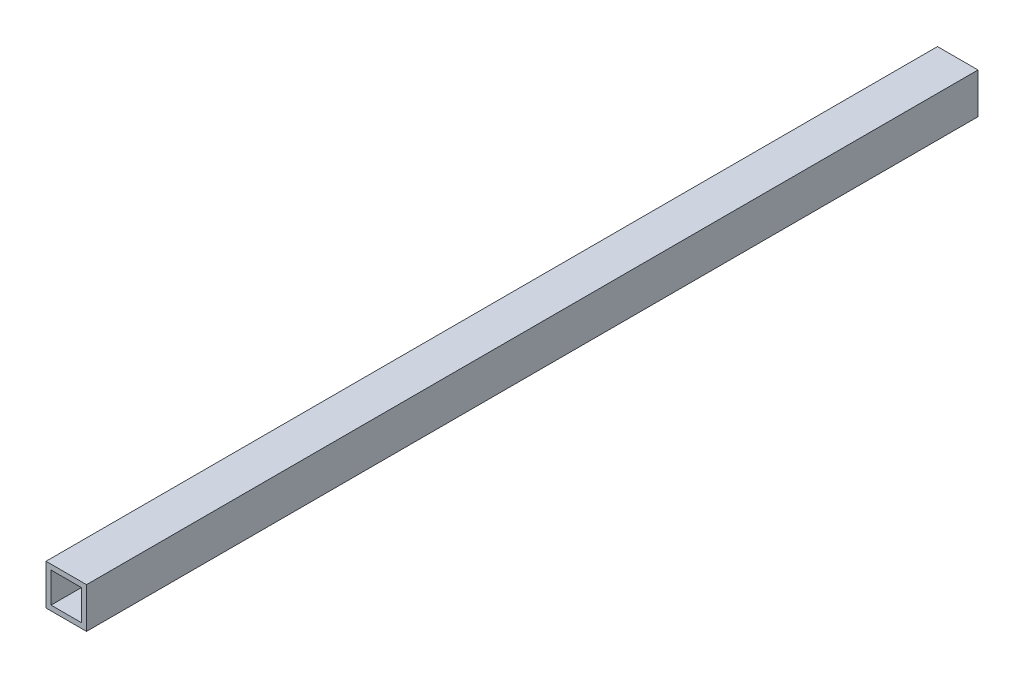
ISO-10303-21;
HEADER;
FILE_DESCRIPTION(('STEP AP214'),'2;1');
FILE_NAME('part.step','',(''),(''),'','','');
FILE_SCHEMA(('AUTOMOTIVE_DESIGN { 1 0 10303 214 1 1 1 1 }'));
ENDSEC;
DATA;
#1=APPLICATION_CONTEXT('core data for automotive mechanical design processes');
#2=APPLICATION_PROTOCOL_DEFINITION('international standard','automotive_design',2000,#1);
#3=PRODUCT_CONTEXT('',#1,'mechanical');
#4=PRODUCT('Part','Part','',(#3));
#5=PRODUCT_RELATED_PRODUCT_CATEGORY('part','',(#4));
#6=PRODUCT_DEFINITION_FORMATION('','',#4);
#7=PRODUCT_DEFINITION_CONTEXT('part definition',#1,'design');
#8=PRODUCT_DEFINITION('design','',#6,#7);
#9=PRODUCT_DEFINITION_SHAPE('','',#8);
#10=(LENGTH_UNIT() NAMED_UNIT(*) SI_UNIT(.MILLI.,.METRE.));
#11=(NAMED_UNIT(*) PLANE_ANGLE_UNIT() SI_UNIT($,.RADIAN.));
#12=(NAMED_UNIT(*) SI_UNIT($,.STERADIAN.) SOLID_ANGLE_UNIT());
#13=UNCERTAINTY_MEASURE_WITH_UNIT(LENGTH_MEASURE(1.E-05),#10,'distance_accuracy_value','');
#14=(GEOMETRIC_REPRESENTATION_CONTEXT(3) GLOBAL_UNCERTAINTY_ASSIGNED_CONTEXT((#13)) GLOBAL_UNIT_ASSIGNED_CONTEXT((#10,
#11,#12)) REPRESENTATION_CONTEXT('',''));
#15=CARTESIAN_POINT('',(0.,0.,0.));
#16=DIRECTION('',(0.,0.,1.));
#17=DIRECTION('',(1.,0.,0.));
#18=AXIS2_PLACEMENT_3D('',#15,#16,#17);
#19=CARTESIAN_POINT('',(0.,0.,558.8));
#20=DIRECTION('',(0.,0.,-1.));
#21=DIRECTION('',(-1.,0.,0.));
#22=AXIS2_PLACEMENT_3D('',#19,#20,#21);
#23=PLANE('',#22);
#24=DIRECTION('',(0.,-1.,0.));
#25=VECTOR('',#24,1.);
#26=CARTESIAN_POINT('',(0.,0.,558.8));
#27=LINE('',#26,#25);
#28=CARTESIAN_POINT('',(0.,25.4,558.8));
#29=VERTEX_POINT('',#28);
#30=CARTESIAN_POINT('',(0.,0.,558.8));
#31=VERTEX_POINT('',#30);
#32=EDGE_CURVE('E156',#29,#31,#27,.T.);
#33=ORIENTED_EDGE('',*,*,#32,.T.);
#34=DIRECTION('',(1.,0.,0.));
#35=VECTOR('',#34,1.);
#36=CARTESIAN_POINT('',(0.,0.,558.8));
#37=LINE('',#36,#35);
#38=CARTESIAN_POINT('',(25.4,0.,558.8));
#39=VERTEX_POINT('',#38);
#40=EDGE_CURVE('E160',#31,#39,#37,.T.);
#41=ORIENTED_EDGE('',*,*,#40,.T.);
#42=DIRECTION('',(0.,1.,0.));
#43=VECTOR('',#42,1.);
#44=CARTESIAN_POINT('',(25.4,0.,558.8));
#45=LINE('',#44,#43);
#46=CARTESIAN_POINT('',(25.4,25.4,558.8));
#47=VERTEX_POINT('',#46);
#48=EDGE_CURVE('E164',#39,#47,#45,.T.);
#49=ORIENTED_EDGE('',*,*,#48,.T.);
#50=DIRECTION('',(-1.,0.,0.));
#51=VECTOR('',#50,1.);
#52=CARTESIAN_POINT('',(0.,25.4,558.8));
#53=LINE('',#52,#51);
#54=EDGE_CURVE('E167',#47,#29,#53,.T.);
#55=ORIENTED_EDGE('',*,*,#54,.T.);
#56=EDGE_LOOP('',(#33,#41,#49,#55));
#57=FACE_BOUND('',#56,.T.);
#58=DIRECTION('',(1.,0.,0.));
#59=VECTOR('',#58,1.);
#60=CARTESIAN_POINT('',(3.175,3.175,558.8));
#61=LINE('',#60,#59);
#62=CARTESIAN_POINT('',(3.175,3.175,558.8));
#63=VERTEX_POINT('',#62);
#64=CARTESIAN_POINT('',(22.225,3.175,558.8));
#65=VERTEX_POINT('',#64);
#66=EDGE_CURVE('E108',#63,#65,#61,.T.);
#67=ORIENTED_EDGE('',*,*,#66,.F.);
#68=DIRECTION('',(0.,-1.,0.));
#69=VECTOR('',#68,1.);
#70=CARTESIAN_POINT('',(3.175,3.175,558.8));
#71=LINE('',#70,#69);
#72=CARTESIAN_POINT('',(3.175,22.225,558.8));
#73=VERTEX_POINT('',#72);
#74=EDGE_CURVE('E134',#73,#63,#71,.T.);
#75=ORIENTED_EDGE('',*,*,#74,.F.);
#76=DIRECTION('',(-1.,0.,0.));
#77=VECTOR('',#76,1.);
#78=CARTESIAN_POINT('',(3.175,22.225,558.8));
#79=LINE('',#78,#77);
#80=CARTESIAN_POINT('',(22.225,22.225,558.8));
#81=VERTEX_POINT('',#80);
#82=EDGE_CURVE('E130',#81,#73,#79,.T.);
#83=ORIENTED_EDGE('',*,*,#82,.F.);
#84=DIRECTION('',(0.,1.,0.));
#85=VECTOR('',#84,1.);
#86=CARTESIAN_POINT('',(22.225,3.175,558.8));
#87=LINE('',#86,#85);
#88=EDGE_CURVE('E117',#65,#81,#87,.T.);
#89=ORIENTED_EDGE('',*,*,#88,.F.);
#90=EDGE_LOOP('',(#67,#75,#83,#89));
#91=FACE_BOUND('',#90,.T.);
#92=ADVANCED_FACE('F42',(#57,#91),#23,.F.);
#93=CARTESIAN_POINT('',(0.,0.,0.));
#94=DIRECTION('',(0.,0.,-1.));
#95=DIRECTION('',(-1.,0.,0.));
#96=AXIS2_PLACEMENT_3D('',#93,#94,#95);
#97=PLANE('',#96);
#98=DIRECTION('',(0.,-1.,0.));
#99=VECTOR('',#98,1.);
#100=CARTESIAN_POINT('',(0.,0.,0.));
#101=LINE('',#100,#99);
#102=CARTESIAN_POINT('',(0.,25.4,0.));
#103=VERTEX_POINT('',#102);
#104=CARTESIAN_POINT('',(0.,0.,0.));
#105=VERTEX_POINT('',#104);
#106=EDGE_CURVE('E126',#103,#105,#101,.T.);
#107=ORIENTED_EDGE('',*,*,#106,.F.);
#108=DIRECTION('',(-1.,0.,0.));
#109=VECTOR('',#108,1.);
#110=CARTESIAN_POINT('',(0.,25.4,0.));
#111=LINE('',#110,#109);
#112=CARTESIAN_POINT('',(25.4,25.4,0.));
#113=VERTEX_POINT('',#112);
#114=EDGE_CURVE('E161',#113,#103,#111,.T.);
#115=ORIENTED_EDGE('',*,*,#114,.F.);
#116=DIRECTION('',(0.,1.,0.));
#117=VECTOR('',#116,1.);
#118=CARTESIAN_POINT('',(25.4,0.,0.));
#119=LINE('',#118,#117);
#120=CARTESIAN_POINT('',(25.4,0.,0.));
#121=VERTEX_POINT('',#120);
#122=EDGE_CURVE('E177',#121,#113,#119,.T.);
#123=ORIENTED_EDGE('',*,*,#122,.F.);
#124=DIRECTION('',(1.,0.,0.));
#125=VECTOR('',#124,1.);
#126=CARTESIAN_POINT('',(0.,0.,0.));
#127=LINE('',#126,#125);
#128=EDGE_CURVE('E174',#105,#121,#127,.T.);
#129=ORIENTED_EDGE('',*,*,#128,.F.);
#130=EDGE_LOOP('',(#107,#115,#123,#129));
#131=FACE_BOUND('',#130,.T.);
#132=DIRECTION('',(0.,-1.,0.));
#133=VECTOR('',#132,1.);
#134=CARTESIAN_POINT('',(3.175,3.175,0.));
#135=LINE('',#134,#133);
#136=CARTESIAN_POINT('',(3.175,22.225,0.));
#137=VERTEX_POINT('',#136);
#138=CARTESIAN_POINT('',(3.175,3.175,0.));
#139=VERTEX_POINT('',#138);
#140=EDGE_CURVE('E118',#137,#139,#135,.T.);
#141=ORIENTED_EDGE('',*,*,#140,.T.);
#142=DIRECTION('',(1.,0.,0.));
#143=VECTOR('',#142,1.);
#144=CARTESIAN_POINT('',(3.175,3.175,0.));
#145=LINE('',#144,#143);
#146=CARTESIAN_POINT('',(22.225,3.175,0.));
#147=VERTEX_POINT('',#146);
#148=EDGE_CURVE('E66',#139,#147,#145,.T.);
#149=ORIENTED_EDGE('',*,*,#148,.T.);
#150=DIRECTION('',(0.,1.,0.));
#151=VECTOR('',#150,1.);
#152=CARTESIAN_POINT('',(22.225,3.175,0.));
#153=LINE('',#152,#151);
#154=CARTESIAN_POINT('',(22.225,22.225,0.));
#155=VERTEX_POINT('',#154);
#156=EDGE_CURVE('E124',#147,#155,#153,.T.);
#157=ORIENTED_EDGE('',*,*,#156,.T.);
#158=DIRECTION('',(-1.,0.,0.));
#159=VECTOR('',#158,1.);
#160=CARTESIAN_POINT('',(3.175,22.225,0.));
#161=LINE('',#160,#159);
#162=EDGE_CURVE('E143',#155,#137,#161,.T.);
#163=ORIENTED_EDGE('',*,*,#162,.T.);
#164=EDGE_LOOP('',(#141,#149,#157,#163));
#165=FACE_BOUND('',#164,.T.);
#166=ADVANCED_FACE('F200',(#131,#165),#97,.T.);
#167=CARTESIAN_POINT('',(0.,0.,558.8));
#168=DIRECTION('',(1.,0.,0.));
#169=DIRECTION('',(0.,0.,-1.));
#170=AXIS2_PLACEMENT_3D('',#167,#168,#169);
#171=PLANE('',#170);
#172=ORIENTED_EDGE('',*,*,#106,.T.);
#173=DIRECTION('',(0.,0.,-1.));
#174=VECTOR('',#173,1.);
#175=CARTESIAN_POINT('',(0.,0.,558.8));
#176=LINE('',#175,#174);
#177=EDGE_CURVE('E11',#31,#105,#176,.T.);
#178=ORIENTED_EDGE('',*,*,#177,.F.);
#179=ORIENTED_EDGE('',*,*,#32,.F.);
#180=DIRECTION('',(0.,0.,-1.));
#181=VECTOR('',#180,1.);
#182=CARTESIAN_POINT('',(0.,25.4,558.8));
#183=LINE('',#182,#181);
#184=EDGE_CURVE('E170',#29,#103,#183,.T.);
#185=ORIENTED_EDGE('',*,*,#184,.T.);
#186=EDGE_LOOP('',(#172,#178,#179,#185));
#187=FACE_BOUND('',#186,.T.);
#188=ADVANCED_FACE('F44',(#187),#171,.F.);
#189=CARTESIAN_POINT('',(0.,0.,558.8));
#190=DIRECTION('',(0.,1.,0.));
#191=DIRECTION('',(0.,0.,1.));
#192=AXIS2_PLACEMENT_3D('',#189,#190,#191);
#193=PLANE('',#192);
#194=ORIENTED_EDGE('',*,*,#128,.T.);
#195=DIRECTION('',(0.,0.,-1.));
#196=VECTOR('',#195,1.);
#197=CARTESIAN_POINT('',(25.4,0.,558.8));
#198=LINE('',#197,#196);
#199=EDGE_CURVE('E51',#39,#121,#198,.T.);
#200=ORIENTED_EDGE('',*,*,#199,.F.);
#201=ORIENTED_EDGE('',*,*,#40,.F.);
#202=ORIENTED_EDGE('',*,*,#177,.T.);
#203=EDGE_LOOP('',(#194,#200,#201,#202));
#204=FACE_BOUND('',#203,.T.);
#205=ADVANCED_FACE('F210',(#204),#193,.F.);
#206=CARTESIAN_POINT('',(25.4,0.,558.8));
#207=DIRECTION('',(-1.,0.,0.));
#208=DIRECTION('',(0.,0.,1.));
#209=AXIS2_PLACEMENT_3D('',#206,#207,#208);
#210=PLANE('',#209);
#211=ORIENTED_EDGE('',*,*,#122,.T.);
#212=DIRECTION('',(0.,0.,-1.));
#213=VECTOR('',#212,1.);
#214=CARTESIAN_POINT('',(25.4,25.4,558.8));
#215=LINE('',#214,#213);
#216=EDGE_CURVE('E185',#47,#113,#215,.T.);
#217=ORIENTED_EDGE('',*,*,#216,.F.);
#218=ORIENTED_EDGE('',*,*,#48,.F.);
#219=ORIENTED_EDGE('',*,*,#199,.T.);
#220=EDGE_LOOP('',(#211,#217,#218,#219));
#221=FACE_BOUND('',#220,.T.);
#222=ADVANCED_FACE('F194',(#221),#210,.F.);
#223=CARTESIAN_POINT('',(0.,25.4,558.8));
#224=DIRECTION('',(0.,-1.,0.));
#225=DIRECTION('',(0.,0.,-1.));
#226=AXIS2_PLACEMENT_3D('',#223,#224,#225);
#227=PLANE('',#226);
#228=ORIENTED_EDGE('',*,*,#114,.T.);
#229=ORIENTED_EDGE('',*,*,#184,.F.);
#230=ORIENTED_EDGE('',*,*,#54,.F.);
#231=ORIENTED_EDGE('',*,*,#216,.T.);
#232=EDGE_LOOP('',(#228,#229,#230,#231));
#233=FACE_BOUND('',#232,.T.);
#234=ADVANCED_FACE('F204',(#233),#227,.F.);
#235=CARTESIAN_POINT('',(3.175,3.175,558.8));
#236=DIRECTION('',(0.,1.,0.));
#237=DIRECTION('',(0.,0.,1.));
#238=AXIS2_PLACEMENT_3D('',#235,#236,#237);
#239=PLANE('',#238);
#240=ORIENTED_EDGE('',*,*,#148,.F.);
#241=DIRECTION('',(0.,0.,-1.));
#242=VECTOR('',#241,1.);
#243=CARTESIAN_POINT('',(3.175,3.175,558.8));
#244=LINE('',#243,#242);
#245=EDGE_CURVE('E112',#63,#139,#244,.T.);
#246=ORIENTED_EDGE('',*,*,#245,.F.);
#247=ORIENTED_EDGE('',*,*,#66,.T.);
#248=DIRECTION('',(0.,0.,-1.));
#249=VECTOR('',#248,1.);
#250=CARTESIAN_POINT('',(22.225,3.175,558.8));
#251=LINE('',#250,#249);
#252=EDGE_CURVE('E111',#65,#147,#251,.T.);
#253=ORIENTED_EDGE('',*,*,#252,.T.);
#254=EDGE_LOOP('',(#240,#246,#247,#253));
#255=FACE_BOUND('',#254,.T.);
#256=ADVANCED_FACE('F110',(#255),#239,.T.);
#257=CARTESIAN_POINT('',(22.225,3.175,558.8));
#258=DIRECTION('',(-1.,0.,0.));
#259=DIRECTION('',(0.,-1.,0.));
#260=AXIS2_PLACEMENT_3D('',#257,#258,#259);
#261=PLANE('',#260);
#262=ORIENTED_EDGE('',*,*,#156,.F.);
#263=ORIENTED_EDGE('',*,*,#252,.F.);
#264=ORIENTED_EDGE('',*,*,#88,.T.);
#265=DIRECTION('',(0.,0.,-1.));
#266=VECTOR('',#265,1.);
#267=CARTESIAN_POINT('',(22.225,22.225,558.8));
#268=LINE('',#267,#266);
#269=EDGE_CURVE('E127',#81,#155,#268,.T.);
#270=ORIENTED_EDGE('',*,*,#269,.T.);
#271=EDGE_LOOP('',(#262,#263,#264,#270));
#272=FACE_BOUND('',#271,.T.);
#273=ADVANCED_FACE('F121',(#272),#261,.T.);
#274=CARTESIAN_POINT('',(3.175,22.225,558.8));
#275=DIRECTION('',(0.,-1.,0.));
#276=DIRECTION('',(1.,0.,0.));
#277=AXIS2_PLACEMENT_3D('',#274,#275,#276);
#278=PLANE('',#277);
#279=ORIENTED_EDGE('',*,*,#162,.F.);
#280=ORIENTED_EDGE('',*,*,#269,.F.);
#281=ORIENTED_EDGE('',*,*,#82,.T.);
#282=DIRECTION('',(0.,0.,-1.));
#283=VECTOR('',#282,1.);
#284=CARTESIAN_POINT('',(3.175,22.225,558.8));
#285=LINE('',#284,#283);
#286=EDGE_CURVE('E58',#73,#137,#285,.T.);
#287=ORIENTED_EDGE('',*,*,#286,.T.);
#288=EDGE_LOOP('',(#279,#280,#281,#287));
#289=FACE_BOUND('',#288,.T.);
#290=ADVANCED_FACE('F233',(#289),#278,.T.);
#291=CARTESIAN_POINT('',(3.175,3.175,558.8));
#292=DIRECTION('',(1.,0.,0.));
#293=DIRECTION('',(0.,0.,-1.));
#294=AXIS2_PLACEMENT_3D('',#291,#292,#293);
#295=PLANE('',#294);
#296=ORIENTED_EDGE('',*,*,#140,.F.);
#297=ORIENTED_EDGE('',*,*,#286,.F.);
#298=ORIENTED_EDGE('',*,*,#74,.T.);
#299=ORIENTED_EDGE('',*,*,#245,.T.);
#300=EDGE_LOOP('',(#296,#297,#298,#299));
#301=FACE_BOUND('',#300,.T.);
#302=ADVANCED_FACE('F237',(#301),#295,.T.);
#303=CLOSED_SHELL('',(#92,#166,#188,#205,#222,#234,#256,#273,#290,#302));
#304=MANIFOLD_SOLID_BREP('B2',#303);
#305=ADVANCED_BREP_SHAPE_REPRESENTATION('',(#18,#304),#14);
#306=SHAPE_DEFINITION_REPRESENTATION(#9,#305);
ENDSEC;
END-ISO-10303-21;
